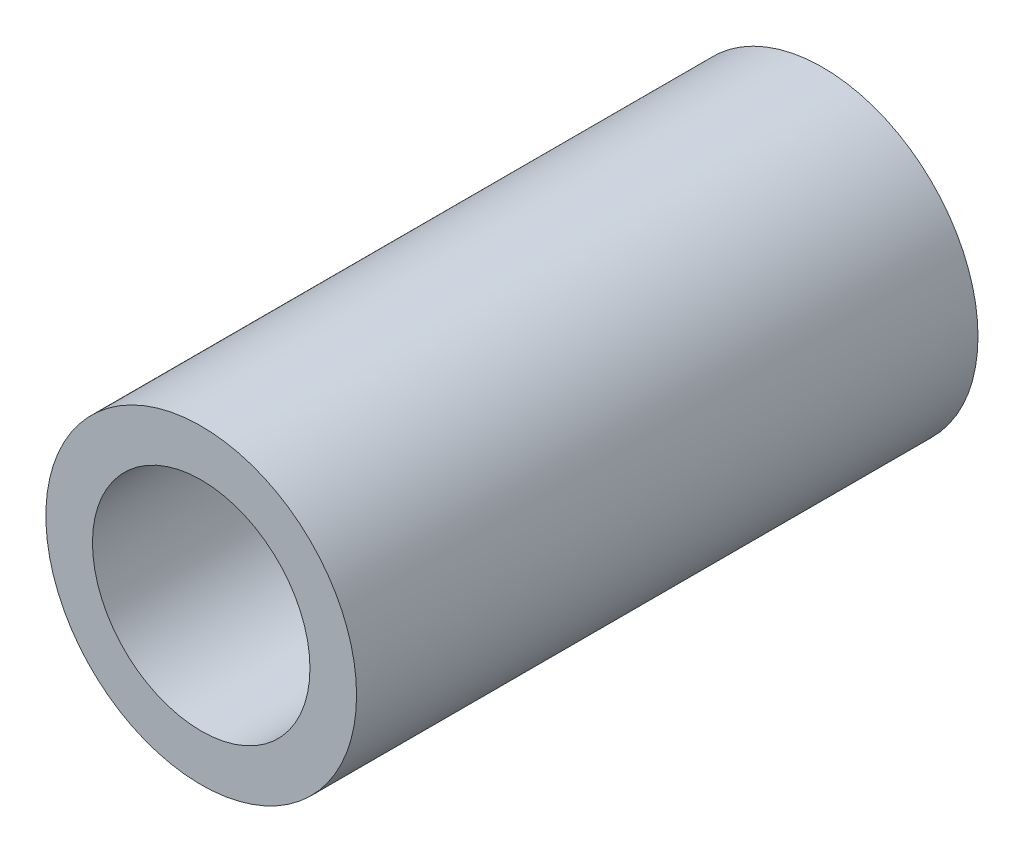
ISO-10303-21;
HEADER;
FILE_DESCRIPTION(('STEP AP214'),'2;1');
FILE_NAME('part.step','',(''),(''),'','','');
FILE_SCHEMA(('AUTOMOTIVE_DESIGN { 1 0 10303 214 1 1 1 1 }'));
ENDSEC;
DATA;
#1=APPLICATION_CONTEXT('core data for automotive mechanical design processes');
#2=APPLICATION_PROTOCOL_DEFINITION('international standard','automotive_design',2000,#1);
#3=PRODUCT_CONTEXT('',#1,'mechanical');
#4=PRODUCT('Part','Part','',(#3));
#5=PRODUCT_RELATED_PRODUCT_CATEGORY('part','',(#4));
#6=PRODUCT_DEFINITION_FORMATION('','',#4);
#7=PRODUCT_DEFINITION_CONTEXT('part definition',#1,'design');
#8=PRODUCT_DEFINITION('design','',#6,#7);
#9=PRODUCT_DEFINITION_SHAPE('','',#8);
#10=(LENGTH_UNIT() NAMED_UNIT(*) SI_UNIT(.MILLI.,.METRE.));
#11=(NAMED_UNIT(*) PLANE_ANGLE_UNIT() SI_UNIT($,.RADIAN.));
#12=(NAMED_UNIT(*) SI_UNIT($,.STERADIAN.) SOLID_ANGLE_UNIT());
#13=UNCERTAINTY_MEASURE_WITH_UNIT(LENGTH_MEASURE(1.E-05),#10,'distance_accuracy_value','');
#14=(GEOMETRIC_REPRESENTATION_CONTEXT(3) GLOBAL_UNCERTAINTY_ASSIGNED_CONTEXT((#13)) GLOBAL_UNIT_ASSIGNED_CONTEXT((#10,
#11,#12)) REPRESENTATION_CONTEXT('',''));
#15=CARTESIAN_POINT('',(0.,0.,0.));
#16=DIRECTION('',(0.,0.,1.));
#17=DIRECTION('',(1.,0.,0.));
#18=AXIS2_PLACEMENT_3D('',#15,#16,#17);
#19=CARTESIAN_POINT('',(0.,0.,10.));
#20=DIRECTION('',(0.,0.,-1.));
#21=DIRECTION('',(-1.,0.,0.));
#22=AXIS2_PLACEMENT_3D('',#19,#20,#21);
#23=CYLINDRICAL_SURFACE('',#22,2.5);
#24=CARTESIAN_POINT('',(0.,0.,10.));
#25=DIRECTION('',(0.,0.,1.));
#26=DIRECTION('',(1.,0.,0.));
#27=AXIS2_PLACEMENT_3D('',#24,#25,#26);
#28=CIRCLE('',#27,2.5);
#29=CARTESIAN_POINT('',(2.5,0.,10.));
#30=VERTEX_POINT('',#29);
#31=EDGE_CURVE('E10',#30,#30,#28,.T.);
#32=ORIENTED_EDGE('',*,*,#31,.F.);
#33=EDGE_LOOP('',(#32));
#34=FACE_BOUND('',#33,.T.);
#35=CARTESIAN_POINT('',(0.,0.,0.));
#36=DIRECTION('',(0.,0.,1.));
#37=DIRECTION('',(1.,0.,0.));
#38=AXIS2_PLACEMENT_3D('',#35,#36,#37);
#39=CIRCLE('',#38,2.5);
#40=CARTESIAN_POINT('',(2.5,0.,0.));
#41=VERTEX_POINT('',#40);
#42=EDGE_CURVE('E36',#41,#41,#39,.T.);
#43=ORIENTED_EDGE('',*,*,#42,.T.);
#44=EDGE_LOOP('',(#43));
#45=FACE_BOUND('',#44,.T.);
#46=ADVANCED_FACE('F33',(#34,#45),#23,.T.);
#47=CARTESIAN_POINT('',(0.,0.,10.));
#48=DIRECTION('',(0.,0.,1.));
#49=DIRECTION('',(1.,0.,0.));
#50=AXIS2_PLACEMENT_3D('',#47,#48,#49);
#51=PLANE('',#50);
#52=CARTESIAN_POINT('',(0.,0.,10.));
#53=DIRECTION('',(0.,0.,1.));
#54=DIRECTION('',(1.,0.,0.));
#55=AXIS2_PLACEMENT_3D('',#52,#53,#54);
#56=CIRCLE('',#55,1.75);
#57=CARTESIAN_POINT('',(1.75,0.,10.));
#58=VERTEX_POINT('',#57);
#59=EDGE_CURVE('E45',#58,#58,#56,.T.);
#60=ORIENTED_EDGE('',*,*,#59,.F.);
#61=EDGE_LOOP('',(#60));
#62=FACE_BOUND('',#61,.T.);
#63=ORIENTED_EDGE('',*,*,#31,.T.);
#64=EDGE_LOOP('',(#63));
#65=FACE_BOUND('',#64,.T.);
#66=ADVANCED_FACE('F60',(#62,#65),#51,.T.);
#67=CARTESIAN_POINT('',(0.,0.,0.));
#68=DIRECTION('',(0.,0.,1.));
#69=DIRECTION('',(1.,0.,0.));
#70=AXIS2_PLACEMENT_3D('',#67,#68,#69);
#71=PLANE('',#70);
#72=CARTESIAN_POINT('',(0.,0.,0.));
#73=DIRECTION('',(0.,0.,1.));
#74=DIRECTION('',(1.,0.,0.));
#75=AXIS2_PLACEMENT_3D('',#72,#73,#74);
#76=CIRCLE('',#75,1.75);
#77=CARTESIAN_POINT('',(1.75,0.,0.));
#78=VERTEX_POINT('',#77);
#79=EDGE_CURVE('E43',#78,#78,#76,.T.);
#80=ORIENTED_EDGE('',*,*,#79,.T.);
#81=EDGE_LOOP('',(#80));
#82=FACE_BOUND('',#81,.T.);
#83=ORIENTED_EDGE('',*,*,#42,.F.);
#84=EDGE_LOOP('',(#83));
#85=FACE_BOUND('',#84,.T.);
#86=ADVANCED_FACE('F51',(#82,#85),#71,.F.);
#87=CARTESIAN_POINT('',(0.,0.,0.));
#88=DIRECTION('',(0.,0.,1.));
#89=DIRECTION('',(1.,0.,0.));
#90=AXIS2_PLACEMENT_3D('',#87,#88,#89);
#91=CYLINDRICAL_SURFACE('',#90,1.75);
#92=ORIENTED_EDGE('',*,*,#79,.F.);
#93=EDGE_LOOP('',(#92));
#94=FACE_BOUND('',#93,.T.);
#95=ORIENTED_EDGE('',*,*,#59,.T.);
#96=EDGE_LOOP('',(#95));
#97=FACE_BOUND('',#96,.T.);
#98=ADVANCED_FACE('F54',(#94,#97),#91,.F.);
#99=CLOSED_SHELL('',(#46,#66,#86,#98));
#100=MANIFOLD_SOLID_BREP('B2',#99);
#101=ADVANCED_BREP_SHAPE_REPRESENTATION('',(#18,#100),#14);
#102=SHAPE_DEFINITION_REPRESENTATION(#9,#101);
ENDSEC;
END-ISO-10303-21;
